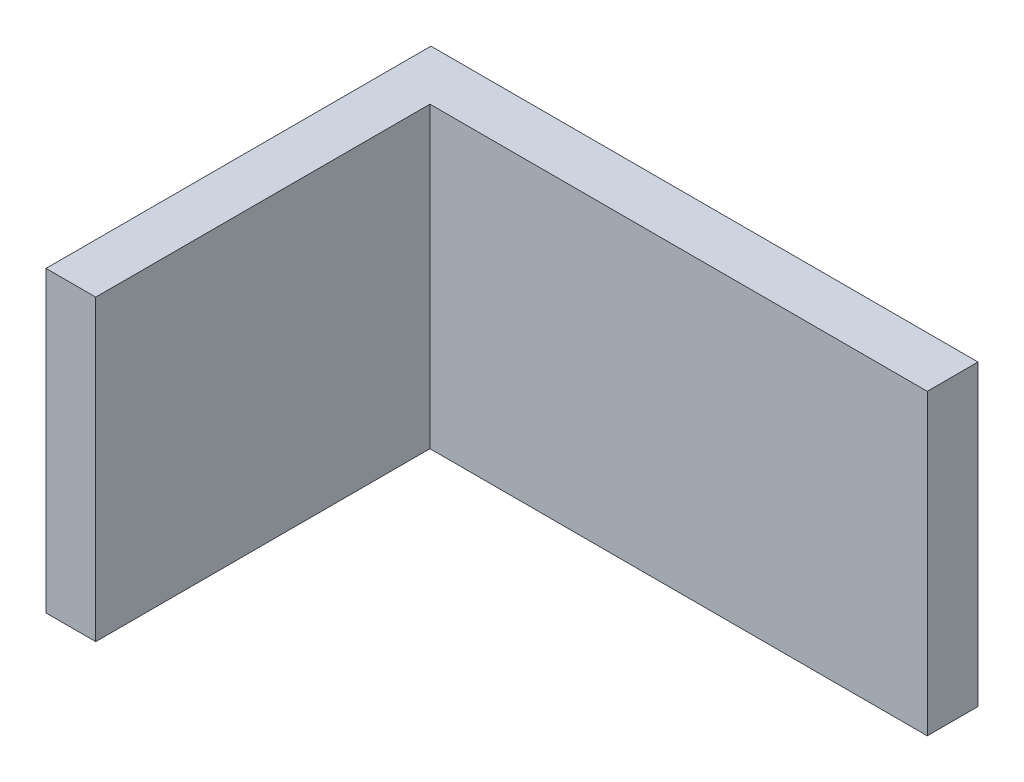
ISO-10303-21;
HEADER;
FILE_DESCRIPTION(('STEP AP214'),'2;1');
FILE_NAME('part.step','',(''),(''),'','','');
FILE_SCHEMA(('AUTOMOTIVE_DESIGN { 1 0 10303 214 1 1 1 1 }'));
ENDSEC;
DATA;
#1=APPLICATION_CONTEXT('core data for automotive mechanical design processes');
#2=APPLICATION_PROTOCOL_DEFINITION('international standard','automotive_design',2000,#1);
#3=PRODUCT_CONTEXT('',#1,'mechanical');
#4=PRODUCT('Part','Part','',(#3));
#5=PRODUCT_RELATED_PRODUCT_CATEGORY('part','',(#4));
#6=PRODUCT_DEFINITION_FORMATION('','',#4);
#7=PRODUCT_DEFINITION_CONTEXT('part definition',#1,'design');
#8=PRODUCT_DEFINITION('design','',#6,#7);
#9=PRODUCT_DEFINITION_SHAPE('','',#8);
#10=(LENGTH_UNIT() NAMED_UNIT(*) SI_UNIT(.MILLI.,.METRE.));
#11=(NAMED_UNIT(*) PLANE_ANGLE_UNIT() SI_UNIT($,.RADIAN.));
#12=(NAMED_UNIT(*) SI_UNIT($,.STERADIAN.) SOLID_ANGLE_UNIT());
#13=UNCERTAINTY_MEASURE_WITH_UNIT(LENGTH_MEASURE(1.E-05),#10,'distance_accuracy_value','');
#14=(GEOMETRIC_REPRESENTATION_CONTEXT(3) GLOBAL_UNCERTAINTY_ASSIGNED_CONTEXT((#13)) GLOBAL_UNIT_ASSIGNED_CONTEXT((#10,
#11,#12)) REPRESENTATION_CONTEXT('',''));
#15=CARTESIAN_POINT('',(0.,0.,0.));
#16=DIRECTION('',(0.,0.,1.));
#17=DIRECTION('',(1.,0.,0.));
#18=AXIS2_PLACEMENT_3D('',#15,#16,#17);
#19=CARTESIAN_POINT('',(-4.55,3.1,0.));
#20=DIRECTION('',(0.,-1.,0.));
#21=DIRECTION('',(0.,0.,1.));
#22=AXIS2_PLACEMENT_3D('',#19,#20,#21);
#23=PLANE('',#22);
#24=DIRECTION('',(-1.,0.,0.));
#25=VECTOR('',#24,1.);
#26=CARTESIAN_POINT('',(-4.,3.1,0.));
#27=LINE('',#26,#25);
#28=CARTESIAN_POINT('',(-4.,3.1,0.));
#29=VERTEX_POINT('',#28);
#30=CARTESIAN_POINT('',(-4.55,3.1,0.));
#31=VERTEX_POINT('',#30);
#32=EDGE_CURVE('E11',#29,#31,#27,.T.);
#33=ORIENTED_EDGE('',*,*,#32,.F.);
#34=DIRECTION('',(0.,0.,-1.));
#35=VECTOR('',#34,1.);
#36=CARTESIAN_POINT('',(-4.,3.1,0.051));
#37=LINE('',#36,#35);
#38=CARTESIAN_POINT('',(-4.,3.1,0.051));
#39=VERTEX_POINT('',#38);
#40=EDGE_CURVE('E24',#39,#29,#37,.T.);
#41=ORIENTED_EDGE('',*,*,#40,.F.);
#42=DIRECTION('',(1.,0.,0.));
#43=VECTOR('',#42,1.);
#44=CARTESIAN_POINT('',(-4.5,3.1,0.051));
#45=LINE('',#44,#43);
#46=CARTESIAN_POINT('',(-4.5,3.1,0.051));
#47=VERTEX_POINT('',#46);
#48=EDGE_CURVE('E87',#47,#39,#45,.T.);
#49=ORIENTED_EDGE('',*,*,#48,.F.);
#50=DIRECTION('',(0.,0.,-1.));
#51=VECTOR('',#50,1.);
#52=CARTESIAN_POINT('',(-4.5,3.1,0.387));
#53=LINE('',#52,#51);
#54=CARTESIAN_POINT('',(-4.5,3.1,0.387));
#55=VERTEX_POINT('',#54);
#56=EDGE_CURVE('E114',#55,#47,#53,.T.);
#57=ORIENTED_EDGE('',*,*,#56,.F.);
#58=DIRECTION('',(1.,0.,0.));
#59=VECTOR('',#58,1.);
#60=CARTESIAN_POINT('',(-4.55,3.1,0.387));
#61=LINE('',#60,#59);
#62=CARTESIAN_POINT('',(-4.55,3.1,0.387));
#63=VERTEX_POINT('',#62);
#64=EDGE_CURVE('E111',#63,#55,#61,.T.);
#65=ORIENTED_EDGE('',*,*,#64,.F.);
#66=DIRECTION('',(0.,0.,1.));
#67=VECTOR('',#66,1.);
#68=CARTESIAN_POINT('',(-4.55,3.1,0.));
#69=LINE('',#68,#67);
#70=EDGE_CURVE('E108',#31,#63,#69,.T.);
#71=ORIENTED_EDGE('',*,*,#70,.F.);
#72=EDGE_LOOP('',(#33,#41,#49,#57,#65,#71));
#73=FACE_BOUND('',#72,.T.);
#74=ADVANCED_FACE('F17',(#73),#23,.T.);
#75=CARTESIAN_POINT('',(-4.,3.4,0.));
#76=DIRECTION('',(0.,1.,0.));
#77=DIRECTION('',(0.,0.,1.));
#78=AXIS2_PLACEMENT_3D('',#75,#76,#77);
#79=PLANE('',#78);
#80=DIRECTION('',(1.,0.,0.));
#81=VECTOR('',#80,1.);
#82=CARTESIAN_POINT('',(-4.55,3.4,0.));
#83=LINE('',#82,#81);
#84=CARTESIAN_POINT('',(-4.55,3.4,0.));
#85=VERTEX_POINT('',#84);
#86=CARTESIAN_POINT('',(-4.,3.4,0.));
#87=VERTEX_POINT('',#86);
#88=EDGE_CURVE('E106',#85,#87,#83,.T.);
#89=ORIENTED_EDGE('',*,*,#88,.F.);
#90=DIRECTION('',(0.,0.,-1.));
#91=VECTOR('',#90,1.);
#92=CARTESIAN_POINT('',(-4.55,3.4,0.387));
#93=LINE('',#92,#91);
#94=CARTESIAN_POINT('',(-4.55,3.4,0.387));
#95=VERTEX_POINT('',#94);
#96=EDGE_CURVE('E103',#95,#85,#93,.T.);
#97=ORIENTED_EDGE('',*,*,#96,.F.);
#98=DIRECTION('',(-1.,0.,0.));
#99=VECTOR('',#98,1.);
#100=CARTESIAN_POINT('',(-4.5,3.4,0.387));
#101=LINE('',#100,#99);
#102=CARTESIAN_POINT('',(-4.5,3.4,0.387));
#103=VERTEX_POINT('',#102);
#104=EDGE_CURVE('E100',#103,#95,#101,.T.);
#105=ORIENTED_EDGE('',*,*,#104,.F.);
#106=DIRECTION('',(0.,0.,1.));
#107=VECTOR('',#106,1.);
#108=CARTESIAN_POINT('',(-4.5,3.4,0.051));
#109=LINE('',#108,#107);
#110=CARTESIAN_POINT('',(-4.5,3.4,0.051));
#111=VERTEX_POINT('',#110);
#112=EDGE_CURVE('E72',#111,#103,#109,.T.);
#113=ORIENTED_EDGE('',*,*,#112,.F.);
#114=DIRECTION('',(-1.,0.,0.));
#115=VECTOR('',#114,1.);
#116=CARTESIAN_POINT('',(-4.,3.4,0.051));
#117=LINE('',#116,#115);
#118=CARTESIAN_POINT('',(-4.,3.4,0.051));
#119=VERTEX_POINT('',#118);
#120=EDGE_CURVE('E66',#119,#111,#117,.T.);
#121=ORIENTED_EDGE('',*,*,#120,.F.);
#122=DIRECTION('',(0.,0.,1.));
#123=VECTOR('',#122,1.);
#124=CARTESIAN_POINT('',(-4.,3.4,0.));
#125=LINE('',#124,#123);
#126=EDGE_CURVE('E69',#87,#119,#125,.T.);
#127=ORIENTED_EDGE('',*,*,#126,.F.);
#128=EDGE_LOOP('',(#89,#97,#105,#113,#121,#127));
#129=FACE_BOUND('',#128,.T.);
#130=ADVANCED_FACE('F68',(#129),#79,.T.);
#131=CARTESIAN_POINT('',(-4.55,3.1,0.387));
#132=DIRECTION('',(0.,0.,1.));
#133=DIRECTION('',(0.,1.,0.));
#134=AXIS2_PLACEMENT_3D('',#131,#132,#133);
#135=PLANE('',#134);
#136=ORIENTED_EDGE('',*,*,#64,.T.);
#137=DIRECTION('',(0.,-1.,0.));
#138=VECTOR('',#137,1.);
#139=CARTESIAN_POINT('',(-4.5,3.4,0.387));
#140=LINE('',#139,#138);
#141=EDGE_CURVE('E83',#103,#55,#140,.T.);
#142=ORIENTED_EDGE('',*,*,#141,.F.);
#143=ORIENTED_EDGE('',*,*,#104,.T.);
#144=DIRECTION('',(0.,1.,0.));
#145=VECTOR('',#144,1.);
#146=CARTESIAN_POINT('',(-4.55,3.1,0.387));
#147=LINE('',#146,#145);
#148=EDGE_CURVE('E88',#63,#95,#147,.T.);
#149=ORIENTED_EDGE('',*,*,#148,.F.);
#150=EDGE_LOOP('',(#136,#142,#143,#149));
#151=FACE_BOUND('',#150,.T.);
#152=ADVANCED_FACE('F125',(#151),#135,.T.);
#153=CARTESIAN_POINT('',(-4.5,3.1,0.051));
#154=DIRECTION('',(0.,0.,1.));
#155=DIRECTION('',(0.,1.,0.));
#156=AXIS2_PLACEMENT_3D('',#153,#154,#155);
#157=PLANE('',#156);
#158=ORIENTED_EDGE('',*,*,#48,.T.);
#159=DIRECTION('',(0.,-1.,0.));
#160=VECTOR('',#159,1.);
#161=CARTESIAN_POINT('',(-4.,3.4,0.051));
#162=LINE('',#161,#160);
#163=EDGE_CURVE('E81',#119,#39,#162,.T.);
#164=ORIENTED_EDGE('',*,*,#163,.F.);
#165=ORIENTED_EDGE('',*,*,#120,.T.);
#166=DIRECTION('',(0.,1.,0.));
#167=VECTOR('',#166,1.);
#168=CARTESIAN_POINT('',(-4.5,3.1,0.051));
#169=LINE('',#168,#167);
#170=EDGE_CURVE('E89',#47,#111,#169,.T.);
#171=ORIENTED_EDGE('',*,*,#170,.F.);
#172=EDGE_LOOP('',(#158,#164,#165,#171));
#173=FACE_BOUND('',#172,.T.);
#174=ADVANCED_FACE('F86',(#173),#157,.T.);
#175=CARTESIAN_POINT('',(-4.55,3.4,0.));
#176=DIRECTION('',(-1.,0.,0.));
#177=DIRECTION('',(0.,0.,1.));
#178=AXIS2_PLACEMENT_3D('',#175,#176,#177);
#179=PLANE('',#178);
#180=DIRECTION('',(0.,1.,0.));
#181=VECTOR('',#180,1.);
#182=CARTESIAN_POINT('',(-4.55,3.1,0.));
#183=LINE('',#182,#181);
#184=EDGE_CURVE('E93',#31,#85,#183,.T.);
#185=ORIENTED_EDGE('',*,*,#184,.F.);
#186=ORIENTED_EDGE('',*,*,#70,.T.);
#187=ORIENTED_EDGE('',*,*,#148,.T.);
#188=ORIENTED_EDGE('',*,*,#96,.T.);
#189=EDGE_LOOP('',(#185,#186,#187,#188));
#190=FACE_BOUND('',#189,.T.);
#191=ADVANCED_FACE('F121',(#190),#179,.T.);
#192=CARTESIAN_POINT('',(-4.,3.1,0.));
#193=DIRECTION('',(1.,0.,0.));
#194=DIRECTION('',(0.,0.,1.));
#195=AXIS2_PLACEMENT_3D('',#192,#193,#194);
#196=PLANE('',#195);
#197=DIRECTION('',(0.,-1.,0.));
#198=VECTOR('',#197,1.);
#199=CARTESIAN_POINT('',(-4.,3.4,0.));
#200=LINE('',#199,#198);
#201=EDGE_CURVE('E82',#87,#29,#200,.T.);
#202=ORIENTED_EDGE('',*,*,#201,.F.);
#203=ORIENTED_EDGE('',*,*,#126,.T.);
#204=ORIENTED_EDGE('',*,*,#163,.T.);
#205=ORIENTED_EDGE('',*,*,#40,.T.);
#206=EDGE_LOOP('',(#202,#203,#204,#205));
#207=FACE_BOUND('',#206,.T.);
#208=ADVANCED_FACE('F80',(#207),#196,.T.);
#209=CARTESIAN_POINT('',(-4.5,3.1,0.051));
#210=DIRECTION('',(1.,0.,0.));
#211=DIRECTION('',(0.,0.,1.));
#212=AXIS2_PLACEMENT_3D('',#209,#210,#211);
#213=PLANE('',#212);
#214=ORIENTED_EDGE('',*,*,#170,.T.);
#215=ORIENTED_EDGE('',*,*,#112,.T.);
#216=ORIENTED_EDGE('',*,*,#141,.T.);
#217=ORIENTED_EDGE('',*,*,#56,.T.);
#218=EDGE_LOOP('',(#214,#215,#216,#217));
#219=FACE_BOUND('',#218,.T.);
#220=ADVANCED_FACE('F127',(#219),#213,.T.);
#221=CARTESIAN_POINT('',(-4.55,3.4,0.));
#222=DIRECTION('',(0.,0.,-1.));
#223=DIRECTION('',(0.,1.,0.));
#224=AXIS2_PLACEMENT_3D('',#221,#222,#223);
#225=PLANE('',#224);
#226=ORIENTED_EDGE('',*,*,#88,.T.);
#227=ORIENTED_EDGE('',*,*,#201,.T.);
#228=ORIENTED_EDGE('',*,*,#32,.T.);
#229=ORIENTED_EDGE('',*,*,#184,.T.);
#230=EDGE_LOOP('',(#226,#227,#228,#229));
#231=FACE_BOUND('',#230,.T.);
#232=ADVANCED_FACE('F117',(#231),#225,.T.);
#233=CLOSED_SHELL('',(#74,#130,#152,#174,#191,#208,#220,#232));
#234=MANIFOLD_SOLID_BREP('B1',#233);
#235=ADVANCED_BREP_SHAPE_REPRESENTATION('',(#18,#234),#14);
#236=SHAPE_DEFINITION_REPRESENTATION(#9,#235);
ENDSEC;
END-ISO-10303-21;
